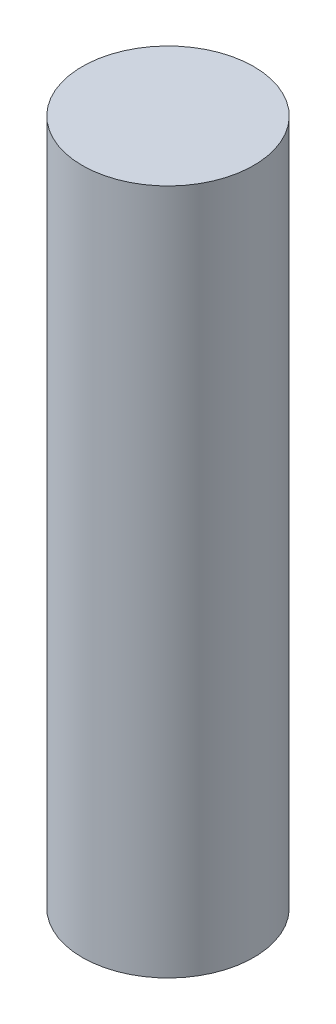
ISO-10303-21;
HEADER;
FILE_DESCRIPTION(('STEP AP214'),'2;1');
FILE_NAME('part.step','',(''),(''),'','','');
FILE_SCHEMA(('AUTOMOTIVE_DESIGN { 1 0 10303 214 1 1 1 1 }'));
ENDSEC;
DATA;
#1=APPLICATION_CONTEXT('core data for automotive mechanical design processes');
#2=APPLICATION_PROTOCOL_DEFINITION('international standard','automotive_design',2000,#1);
#3=PRODUCT_CONTEXT('',#1,'mechanical');
#4=PRODUCT('Part','Part','',(#3));
#5=PRODUCT_RELATED_PRODUCT_CATEGORY('part','',(#4));
#6=PRODUCT_DEFINITION_FORMATION('','',#4);
#7=PRODUCT_DEFINITION_CONTEXT('part definition',#1,'design');
#8=PRODUCT_DEFINITION('design','',#6,#7);
#9=PRODUCT_DEFINITION_SHAPE('','',#8);
#10=(LENGTH_UNIT() NAMED_UNIT(*) SI_UNIT(.MILLI.,.METRE.));
#11=(NAMED_UNIT(*) PLANE_ANGLE_UNIT() SI_UNIT($,.RADIAN.));
#12=(NAMED_UNIT(*) SI_UNIT($,.STERADIAN.) SOLID_ANGLE_UNIT());
#13=UNCERTAINTY_MEASURE_WITH_UNIT(LENGTH_MEASURE(1.E-05),#10,'distance_accuracy_value','');
#14=(GEOMETRIC_REPRESENTATION_CONTEXT(3) GLOBAL_UNCERTAINTY_ASSIGNED_CONTEXT((#13)) GLOBAL_UNIT_ASSIGNED_CONTEXT((#10,
#11,#12)) REPRESENTATION_CONTEXT('',''));
#15=CARTESIAN_POINT('',(0.,0.,0.));
#16=DIRECTION('',(0.,0.,1.));
#17=DIRECTION('',(1.,0.,0.));
#18=AXIS2_PLACEMENT_3D('',#15,#16,#17);
#19=CARTESIAN_POINT('',(0.,304.8,0.));
#20=DIRECTION('',(0.,-1.,0.));
#21=DIRECTION('',(0.,0.,-1.));
#22=AXIS2_PLACEMENT_3D('',#19,#20,#21);
#23=CYLINDRICAL_SURFACE('',#22,38.1);
#24=CARTESIAN_POINT('',(0.,304.8,0.));
#25=DIRECTION('',(0.,1.,0.));
#26=DIRECTION('',(0.,0.,1.));
#27=AXIS2_PLACEMENT_3D('',#24,#25,#26);
#28=CIRCLE('',#27,38.1);
#29=CARTESIAN_POINT('',(0.,304.8,38.1));
#30=VERTEX_POINT('',#29);
#31=EDGE_CURVE('E10',#30,#30,#28,.T.);
#32=ORIENTED_EDGE('',*,*,#31,.F.);
#33=EDGE_LOOP('',(#32));
#34=FACE_BOUND('',#33,.T.);
#35=CARTESIAN_POINT('',(0.,0.,0.));
#36=DIRECTION('',(0.,1.,0.));
#37=DIRECTION('',(0.,0.,1.));
#38=AXIS2_PLACEMENT_3D('',#35,#36,#37);
#39=CIRCLE('',#38,38.1);
#40=CARTESIAN_POINT('',(0.,0.,38.1));
#41=VERTEX_POINT('',#40);
#42=EDGE_CURVE('E40',#41,#41,#39,.T.);
#43=ORIENTED_EDGE('',*,*,#42,.T.);
#44=EDGE_LOOP('',(#43));
#45=FACE_BOUND('',#44,.T.);
#46=ADVANCED_FACE('F37',(#34,#45),#23,.T.);
#47=CARTESIAN_POINT('',(0.,304.8,0.));
#48=DIRECTION('',(0.,1.,0.));
#49=DIRECTION('',(0.,0.,1.));
#50=AXIS2_PLACEMENT_3D('',#47,#48,#49);
#51=PLANE('',#50);
#52=ORIENTED_EDGE('',*,*,#31,.T.);
#53=EDGE_LOOP('',(#52));
#54=FACE_BOUND('',#53,.T.);
#55=ADVANCED_FACE('F52',(#54),#51,.T.);
#56=CARTESIAN_POINT('',(0.,0.,0.));
#57=DIRECTION('',(0.,1.,0.));
#58=DIRECTION('',(0.,0.,1.));
#59=AXIS2_PLACEMENT_3D('',#56,#57,#58);
#60=PLANE('',#59);
#61=ORIENTED_EDGE('',*,*,#42,.F.);
#62=EDGE_LOOP('',(#61));
#63=FACE_BOUND('',#62,.T.);
#64=ADVANCED_FACE('F50',(#63),#60,.F.);
#65=CLOSED_SHELL('',(#46,#55,#64));
#66=MANIFOLD_SOLID_BREP('B2',#65);
#67=ADVANCED_BREP_SHAPE_REPRESENTATION('',(#18,#66),#14);
#68=SHAPE_DEFINITION_REPRESENTATION(#9,#67);
ENDSEC;
END-ISO-10303-21;
